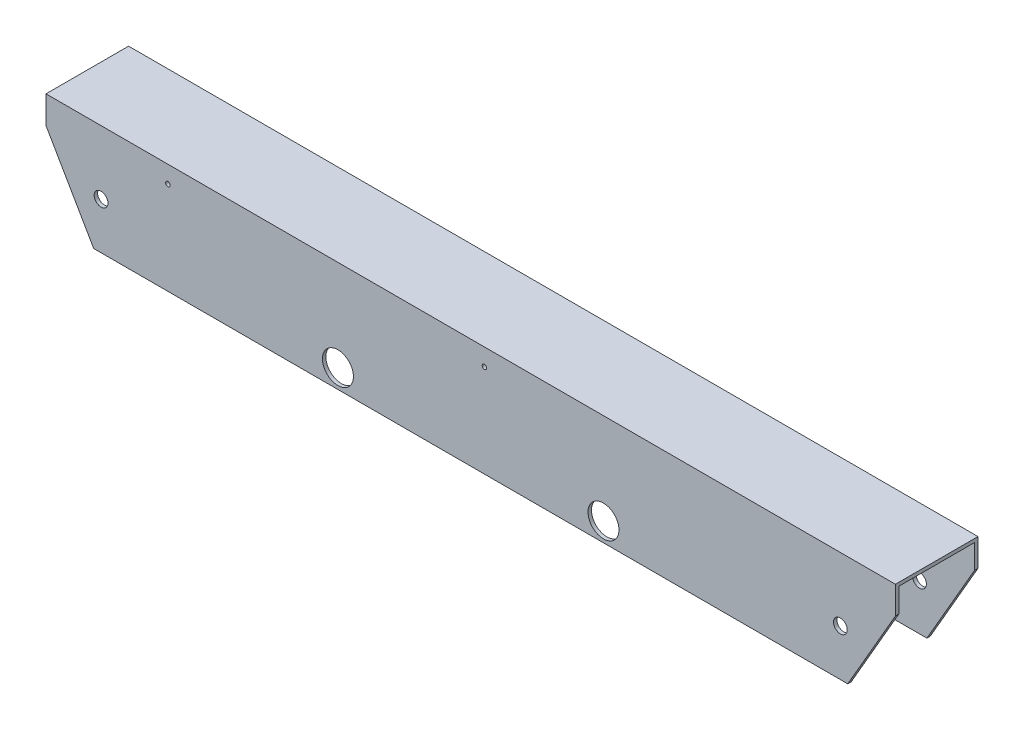
ISO-10303-21;
HEADER;
FILE_DESCRIPTION(('STEP AP214'),'2;1');
FILE_NAME('part.step','',(''),(''),'','','');
FILE_SCHEMA(('AUTOMOTIVE_DESIGN { 1 0 10303 214 1 1 1 1 }'));
ENDSEC;
DATA;
#1=APPLICATION_CONTEXT('core data for automotive mechanical design processes');
#2=APPLICATION_PROTOCOL_DEFINITION('international standard','automotive_design',2000,#1);
#3=PRODUCT_CONTEXT('',#1,'mechanical');
#4=PRODUCT('Part','Part','',(#3));
#5=PRODUCT_RELATED_PRODUCT_CATEGORY('part','',(#4));
#6=PRODUCT_DEFINITION_FORMATION('','',#4);
#7=PRODUCT_DEFINITION_CONTEXT('part definition',#1,'design');
#8=PRODUCT_DEFINITION('design','',#6,#7);
#9=PRODUCT_DEFINITION_SHAPE('','',#8);
#10=(LENGTH_UNIT() NAMED_UNIT(*) SI_UNIT(.MILLI.,.METRE.));
#11=(NAMED_UNIT(*) PLANE_ANGLE_UNIT() SI_UNIT($,.RADIAN.));
#12=(NAMED_UNIT(*) SI_UNIT($,.STERADIAN.) SOLID_ANGLE_UNIT());
#13=UNCERTAINTY_MEASURE_WITH_UNIT(LENGTH_MEASURE(1.E-05),#10,'distance_accuracy_value','');
#14=(GEOMETRIC_REPRESENTATION_CONTEXT(3) GLOBAL_UNCERTAINTY_ASSIGNED_CONTEXT((#13)) GLOBAL_UNIT_ASSIGNED_CONTEXT((#10,
#11,#12)) REPRESENTATION_CONTEXT('',''));
#15=CARTESIAN_POINT('',(0.,0.,0.));
#16=DIRECTION('',(0.,0.,1.));
#17=DIRECTION('',(1.,0.,0.));
#18=AXIS2_PLACEMENT_3D('',#15,#16,#17);
#19=CARTESIAN_POINT('',(391.865756272,-50.8,-38.1));
#20=DIRECTION('',(0.,1.,0.));
#21=DIRECTION('',(0.,0.,1.));
#22=AXIS2_PLACEMENT_3D('',#19,#20,#21);
#23=PLANE('',#22);
#24=DIRECTION('',(-1.,0.,0.));
#25=VECTOR('',#24,1.);
#26=CARTESIAN_POINT('',(391.865756272,-50.8,-38.1));
#27=LINE('',#26,#25);
#28=CARTESIAN_POINT('',(347.87166575975,-50.7999999999999,-38.1));
#29=VERTEX_POINT('',#28);
#30=CARTESIAN_POINT('',(-347.87166575975,-50.8,-38.1));
#31=VERTEX_POINT('',#30);
#32=EDGE_CURVE('E199',#29,#31,#27,.T.);
#33=ORIENTED_EDGE('',*,*,#32,.F.);
#34=DIRECTION('',(0.,0.,1.));
#35=VECTOR('',#34,1.);
#36=CARTESIAN_POINT('',(347.87166575975,-50.7999999999999,-63.5));
#37=LINE('',#36,#35);
#38=CARTESIAN_POINT('',(347.87166575975,-50.7999999999999,-34.925));
#39=VERTEX_POINT('',#38);
#40=EDGE_CURVE('E182',#29,#39,#37,.T.);
#41=ORIENTED_EDGE('',*,*,#40,.T.);
#42=DIRECTION('',(-1.,0.,0.));
#43=VECTOR('',#42,1.);
#44=CARTESIAN_POINT('',(391.865756272,-50.8,-34.925));
#45=LINE('',#44,#43);
#46=CARTESIAN_POINT('',(-347.87166575975,-50.8,-34.925));
#47=VERTEX_POINT('',#46);
#48=EDGE_CURVE('E289',#39,#47,#45,.T.);
#49=ORIENTED_EDGE('',*,*,#48,.T.);
#50=DIRECTION('',(0.,0.,1.));
#51=VECTOR('',#50,1.);
#52=CARTESIAN_POINT('',(-347.87166575975,-50.8,-63.5));
#53=LINE('',#52,#51);
#54=EDGE_CURVE('E412',#31,#47,#53,.T.);
#55=ORIENTED_EDGE('',*,*,#54,.F.);
#56=EDGE_LOOP('',(#33,#41,#49,#55));
#57=FACE_BOUND('',#56,.T.);
#58=ADVANCED_FACE('F33',(#57),#23,.F.);
#59=CARTESIAN_POINT('',(391.865756272,50.8,-38.1));
#60=DIRECTION('',(0.,0.,1.));
#61=DIRECTION('',(0.,-1.,0.));
#62=AXIS2_PLACEMENT_3D('',#59,#60,#61);
#63=PLANE('',#62);
#64=DIRECTION('',(1.,0.,0.));
#65=VECTOR('',#64,1.);
#66=CARTESIAN_POINT('',(-266.7,47.625,-38.1));
#67=LINE('',#66,#65);
#68=CARTESIAN_POINT('',(-292.1,47.625,-38.1));
#69=VERTEX_POINT('',#68);
#70=CARTESIAN_POINT('',(-266.7,47.625,-38.1));
#71=VERTEX_POINT('',#70);
#72=EDGE_CURVE('E402',#69,#71,#67,.T.);
#73=ORIENTED_EDGE('',*,*,#72,.F.);
#74=DIRECTION('',(0.,1.,0.));
#75=VECTOR('',#74,1.);
#76=CARTESIAN_POINT('',(-292.1,22.225,-38.1));
#77=LINE('',#76,#75);
#78=CARTESIAN_POINT('',(-292.1,22.225,-38.1));
#79=VERTEX_POINT('',#78);
#80=EDGE_CURVE('E405',#79,#69,#77,.T.);
#81=ORIENTED_EDGE('',*,*,#80,.F.);
#82=DIRECTION('',(-1.,0.,0.));
#83=VECTOR('',#82,1.);
#84=CARTESIAN_POINT('',(-266.7,22.225,-38.1));
#85=LINE('',#84,#83);
#86=CARTESIAN_POINT('',(-266.7,22.225,-38.1));
#87=VERTEX_POINT('',#86);
#88=EDGE_CURVE('E392',#87,#79,#85,.T.);
#89=ORIENTED_EDGE('',*,*,#88,.F.);
#90=DIRECTION('',(0.,-1.,0.));
#91=VECTOR('',#90,1.);
#92=CARTESIAN_POINT('',(-266.7,22.225,-38.1));
#93=LINE('',#92,#91);
#94=EDGE_CURVE('E399',#71,#87,#93,.T.);
#95=ORIENTED_EDGE('',*,*,#94,.F.);
#96=EDGE_LOOP('',(#73,#81,#89,#95));
#97=FACE_BOUND('',#96,.T.);
#98=DIRECTION('',(1.,0.,0.));
#99=VECTOR('',#98,1.);
#100=CARTESIAN_POINT('',(25.4,47.625,-38.1));
#101=LINE('',#100,#99);
#102=CARTESIAN_POINT('',(0.,47.625,-38.1));
#103=VERTEX_POINT('',#102);
#104=CARTESIAN_POINT('',(25.4,47.625,-38.1));
#105=VERTEX_POINT('',#104);
#106=EDGE_CURVE('E382',#103,#105,#101,.T.);
#107=ORIENTED_EDGE('',*,*,#106,.F.);
#108=DIRECTION('',(0.,1.,0.));
#109=VECTOR('',#108,1.);
#110=CARTESIAN_POINT('',(0.,22.225,-38.1));
#111=LINE('',#110,#109);
#112=CARTESIAN_POINT('',(0.,22.225,-38.1));
#113=VERTEX_POINT('',#112);
#114=EDGE_CURVE('E385',#113,#103,#111,.T.);
#115=ORIENTED_EDGE('',*,*,#114,.F.);
#116=DIRECTION('',(-1.,0.,0.));
#117=VECTOR('',#116,1.);
#118=CARTESIAN_POINT('',(25.4,22.225,-38.1));
#119=LINE('',#118,#117);
#120=CARTESIAN_POINT('',(25.4,22.225,-38.1));
#121=VERTEX_POINT('',#120);
#122=EDGE_CURVE('E372',#121,#113,#119,.T.);
#123=ORIENTED_EDGE('',*,*,#122,.F.);
#124=DIRECTION('',(0.,-1.,0.));
#125=VECTOR('',#124,1.);
#126=CARTESIAN_POINT('',(25.4,22.225,-38.1));
#127=LINE('',#126,#125);
#128=EDGE_CURVE('E379',#105,#121,#127,.T.);
#129=ORIENTED_EDGE('',*,*,#128,.F.);
#130=EDGE_LOOP('',(#107,#115,#123,#129));
#131=FACE_BOUND('',#130,.T.);
#132=CARTESIAN_POINT('',(84.41182,-35.123476108,-38.1));
#133=DIRECTION('',(0.,0.,-1.));
#134=DIRECTION('',(0.,1.,0.));
#135=AXIS2_PLACEMENT_3D('',#132,#133,#134);
#136=CIRCLE('',#135,3.302);
#137=CARTESIAN_POINT('',(84.41182,-31.821476108,-38.1));
#138=VERTEX_POINT('',#137);
#139=EDGE_CURVE('E237',#138,#138,#136,.T.);
#140=ORIENTED_EDGE('',*,*,#139,.F.);
#141=EDGE_LOOP('',(#140));
#142=FACE_BOUND('',#141,.T.);
#143=CARTESIAN_POINT('',(84.41182,41.076523892,-38.1));
#144=DIRECTION('',(0.,0.,-1.));
#145=DIRECTION('',(0.,1.,0.));
#146=AXIS2_PLACEMENT_3D('',#143,#144,#145);
#147=CIRCLE('',#146,3.302);
#148=CARTESIAN_POINT('',(84.41182,44.378523892,-38.1));
#149=VERTEX_POINT('',#148);
#150=EDGE_CURVE('E233',#149,#149,#147,.T.);
#151=ORIENTED_EDGE('',*,*,#150,.F.);
#152=EDGE_LOOP('',(#151));
#153=FACE_BOUND('',#152,.T.);
#154=CARTESIAN_POINT('',(160.61182,41.076523892,-38.1));
#155=DIRECTION('',(0.,0.,-1.));
#156=DIRECTION('',(0.,1.,0.));
#157=AXIS2_PLACEMENT_3D('',#154,#155,#156);
#158=CIRCLE('',#157,3.30200000000001);
#159=CARTESIAN_POINT('',(160.61182,44.378523892,-38.1));
#160=VERTEX_POINT('',#159);
#161=EDGE_CURVE('E229',#160,#160,#158,.T.);
#162=ORIENTED_EDGE('',*,*,#161,.F.);
#163=EDGE_LOOP('',(#162));
#164=FACE_BOUND('',#163,.T.);
#165=CARTESIAN_POINT('',(160.61182,-35.123476108,-38.1));
#166=DIRECTION('',(0.,0.,-1.));
#167=DIRECTION('',(0.,1.,0.));
#168=AXIS2_PLACEMENT_3D('',#165,#166,#167);
#169=CIRCLE('',#168,3.30200000000001);
#170=CARTESIAN_POINT('',(160.61182,-31.821476108,-38.1));
#171=VERTEX_POINT('',#170);
#172=EDGE_CURVE('E225',#171,#171,#169,.T.);
#173=ORIENTED_EDGE('',*,*,#172,.F.);
#174=EDGE_LOOP('',(#173));
#175=FACE_BOUND('',#174,.T.);
#176=CARTESIAN_POINT('',(-122.51182,-33.3375,-38.1));
#177=DIRECTION('',(0.,0.,1.));
#178=DIRECTION('',(0.,-1.,0.));
#179=AXIS2_PLACEMENT_3D('',#176,#177,#178);
#180=CIRCLE('',#179,14.2875);
#181=CARTESIAN_POINT('',(-122.51182,-47.625,-38.1));
#182=VERTEX_POINT('',#181);
#183=EDGE_CURVE('E352',#182,#182,#180,.T.);
#184=ORIENTED_EDGE('',*,*,#183,.T.);
#185=EDGE_LOOP('',(#184));
#186=FACE_BOUND('',#185,.T.);
#187=CARTESIAN_POINT('',(341.06575618739,-7.93750000000003,-38.1));
#188=DIRECTION('',(0.,0.,1.));
#189=DIRECTION('',(0.,-1.,0.));
#190=AXIS2_PLACEMENT_3D('',#187,#188,#189);
#191=CIRCLE('',#190,6.35);
#192=CARTESIAN_POINT('',(341.06575618739,-14.2875,-38.1));
#193=VERTEX_POINT('',#192);
#194=EDGE_CURVE('E333',#193,#193,#191,.T.);
#195=ORIENTED_EDGE('',*,*,#194,.T.);
#196=EDGE_LOOP('',(#195));
#197=FACE_BOUND('',#196,.T.);
#198=CARTESIAN_POINT('',(122.51182,-33.3375,-38.1));
#199=DIRECTION('',(0.,0.,1.));
#200=DIRECTION('',(0.,-1.,0.));
#201=AXIS2_PLACEMENT_3D('',#198,#199,#200);
#202=CIRCLE('',#201,14.2875);
#203=CARTESIAN_POINT('',(122.51182,-47.625,-38.1));
#204=VERTEX_POINT('',#203);
#205=EDGE_CURVE('E326',#204,#204,#202,.T.);
#206=ORIENTED_EDGE('',*,*,#205,.T.);
#207=EDGE_LOOP('',(#206));
#208=FACE_BOUND('',#207,.T.);
#209=CARTESIAN_POINT('',(-341.06575618739,-7.93750000000003,-38.1));
#210=DIRECTION('',(0.,0.,1.));
#211=DIRECTION('',(0.,-1.,0.));
#212=AXIS2_PLACEMENT_3D('',#209,#210,#211);
#213=CIRCLE('',#212,6.35);
#214=CARTESIAN_POINT('',(-341.06575618739,-14.2875,-38.1));
#215=VERTEX_POINT('',#214);
#216=EDGE_CURVE('E311',#215,#215,#213,.T.);
#217=ORIENTED_EDGE('',*,*,#216,.T.);
#218=EDGE_LOOP('',(#217));
#219=FACE_BOUND('',#218,.T.);
#220=DIRECTION('',(0.,1.,0.));
#221=VECTOR('',#220,1.);
#222=CARTESIAN_POINT('',(391.865756272,50.8,-38.1));
#223=LINE('',#222,#221);
#224=CARTESIAN_POINT('',(391.865756272,25.4,-38.1));
#225=VERTEX_POINT('',#224);
#226=CARTESIAN_POINT('',(391.865756272,50.8,-38.1));
#227=VERTEX_POINT('',#226);
#228=EDGE_CURVE('E280',#225,#227,#223,.T.);
#229=ORIENTED_EDGE('',*,*,#228,.F.);
#230=DIRECTION('',(-0.500000000000005,-0.866025403784436,0.));
#231=VECTOR('',#230,1.);
#232=CARTESIAN_POINT('',(402.864278900063,44.4499999999999,-38.1));
#233=LINE('',#232,#231);
#234=EDGE_CURVE('E54',#225,#29,#233,.T.);
#235=ORIENTED_EDGE('',*,*,#234,.T.);
#236=ORIENTED_EDGE('',*,*,#32,.T.);
#237=DIRECTION('',(-0.500000000000004,0.866025403784436,0.));
#238=VECTOR('',#237,1.);
#239=CARTESIAN_POINT('',(-206.931400764059,-294.915699804755,-38.1));
#240=LINE('',#239,#238);
#241=CARTESIAN_POINT('',(-391.865756272,25.4,-38.1));
#242=VERTEX_POINT('',#241);
#243=EDGE_CURVE('E407',#31,#242,#240,.T.);
#244=ORIENTED_EDGE('',*,*,#243,.T.);
#245=DIRECTION('',(0.,1.,0.));
#246=VECTOR('',#245,1.);
#247=CARTESIAN_POINT('',(-391.865756272,50.8,-38.1));
#248=LINE('',#247,#246);
#249=CARTESIAN_POINT('',(-391.865756272,50.8,-38.1));
#250=VERTEX_POINT('',#249);
#251=EDGE_CURVE('E268',#242,#250,#248,.T.);
#252=ORIENTED_EDGE('',*,*,#251,.T.);
#253=DIRECTION('',(-1.,0.,0.));
#254=VECTOR('',#253,1.);
#255=CARTESIAN_POINT('',(391.865756272,50.8,-38.1));
#256=LINE('',#255,#254);
#257=EDGE_CURVE('E191',#227,#250,#256,.T.);
#258=ORIENTED_EDGE('',*,*,#257,.F.);
#259=EDGE_LOOP('',(#229,#235,#236,#244,#252,#258));
#260=FACE_BOUND('',#259,.T.);
#261=ADVANCED_FACE('F429',(#97,#131,#142,#153,#164,#175,#186,#197,#208,#219,#260),#63,.F.);
#262=CARTESIAN_POINT('',(391.865756272,50.8,38.1));
#263=DIRECTION('',(0.,-1.,0.));
#264=DIRECTION('',(0.,0.,-1.));
#265=AXIS2_PLACEMENT_3D('',#262,#263,#264);
#266=PLANE('',#265);
#267=DIRECTION('',(0.,0.,1.));
#268=VECTOR('',#267,1.);
#269=CARTESIAN_POINT('',(-391.865756272,50.8,38.1));
#270=LINE('',#269,#268);
#271=CARTESIAN_POINT('',(-391.865756272,50.8,38.1));
#272=VERTEX_POINT('',#271);
#273=EDGE_CURVE('E306',#250,#272,#270,.T.);
#274=ORIENTED_EDGE('',*,*,#273,.T.);
#275=DIRECTION('',(-1.,0.,0.));
#276=VECTOR('',#275,1.);
#277=CARTESIAN_POINT('',(391.865756272,50.8,38.1));
#278=LINE('',#277,#276);
#279=CARTESIAN_POINT('',(391.865756272,50.8,38.1));
#280=VERTEX_POINT('',#279);
#281=EDGE_CURVE('E188',#280,#272,#278,.T.);
#282=ORIENTED_EDGE('',*,*,#281,.F.);
#283=DIRECTION('',(0.,0.,1.));
#284=VECTOR('',#283,1.);
#285=CARTESIAN_POINT('',(391.865756272,50.8,38.1));
#286=LINE('',#285,#284);
#287=EDGE_CURVE('E283',#227,#280,#286,.T.);
#288=ORIENTED_EDGE('',*,*,#287,.F.);
#289=ORIENTED_EDGE('',*,*,#257,.T.);
#290=EDGE_LOOP('',(#274,#282,#288,#289));
#291=FACE_BOUND('',#290,.T.);
#292=ADVANCED_FACE('F465',(#291),#266,.F.);
#293=CARTESIAN_POINT('',(391.865756272,50.8,38.1));
#294=DIRECTION('',(0.,0.,-1.));
#295=DIRECTION('',(0.,1.,0.));
#296=AXIS2_PLACEMENT_3D('',#293,#294,#295);
#297=PLANE('',#296);
#298=CARTESIAN_POINT('',(-122.51182,-33.3375,38.1));
#299=DIRECTION('',(0.,0.,1.));
#300=DIRECTION('',(1.,0.,0.));
#301=AXIS2_PLACEMENT_3D('',#298,#299,#300);
#302=CIRCLE('',#301,14.2875);
#303=CARTESIAN_POINT('',(-108.22432,-33.3375,38.1));
#304=VERTEX_POINT('',#303);
#305=EDGE_CURVE('E221',#304,#304,#302,.T.);
#306=ORIENTED_EDGE('',*,*,#305,.F.);
#307=EDGE_LOOP('',(#306));
#308=FACE_BOUND('',#307,.T.);
#309=CARTESIAN_POINT('',(-279.4,34.925,38.1));
#310=DIRECTION('',(0.,0.,1.));
#311=DIRECTION('',(1.,0.,0.));
#312=AXIS2_PLACEMENT_3D('',#309,#310,#311);
#313=CIRCLE('',#312,2.08280000000001);
#314=CARTESIAN_POINT('',(-277.3172,34.925,38.1));
#315=VERTEX_POINT('',#314);
#316=EDGE_CURVE('E349',#315,#315,#313,.T.);
#317=ORIENTED_EDGE('',*,*,#316,.F.);
#318=EDGE_LOOP('',(#317));
#319=FACE_BOUND('',#318,.T.);
#320=CARTESIAN_POINT('',(12.7,34.925,38.1));
#321=DIRECTION('',(0.,0.,1.));
#322=DIRECTION('',(1.,0.,0.));
#323=AXIS2_PLACEMENT_3D('',#320,#321,#322);
#324=CIRCLE('',#323,2.0828);
#325=CARTESIAN_POINT('',(14.7828,34.925,38.1));
#326=VERTEX_POINT('',#325);
#327=EDGE_CURVE('E343',#326,#326,#324,.T.);
#328=ORIENTED_EDGE('',*,*,#327,.F.);
#329=EDGE_LOOP('',(#328));
#330=FACE_BOUND('',#329,.T.);
#331=CARTESIAN_POINT('',(341.06575618739,-7.93750000000003,38.1));
#332=DIRECTION('',(0.,0.,1.));
#333=DIRECTION('',(-1.,0.,0.));
#334=AXIS2_PLACEMENT_3D('',#331,#332,#333);
#335=CIRCLE('',#334,6.35);
#336=CARTESIAN_POINT('',(334.71575618739,-7.93750000000003,38.1));
#337=VERTEX_POINT('',#336);
#338=EDGE_CURVE('E216',#337,#337,#335,.T.);
#339=ORIENTED_EDGE('',*,*,#338,.F.);
#340=EDGE_LOOP('',(#339));
#341=FACE_BOUND('',#340,.T.);
#342=CARTESIAN_POINT('',(122.51182,-33.3375,38.1));
#343=DIRECTION('',(0.,0.,1.));
#344=DIRECTION('',(-1.,0.,0.));
#345=AXIS2_PLACEMENT_3D('',#342,#343,#344);
#346=CIRCLE('',#345,14.2875);
#347=CARTESIAN_POINT('',(108.22432,-33.3375,38.1));
#348=VERTEX_POINT('',#347);
#349=EDGE_CURVE('E211',#348,#348,#346,.T.);
#350=ORIENTED_EDGE('',*,*,#349,.F.);
#351=EDGE_LOOP('',(#350));
#352=FACE_BOUND('',#351,.T.);
#353=CARTESIAN_POINT('',(-341.06575618739,-7.93750000000003,38.1));
#354=DIRECTION('',(0.,0.,1.));
#355=DIRECTION('',(1.,0.,0.));
#356=AXIS2_PLACEMENT_3D('',#353,#354,#355);
#357=CIRCLE('',#356,6.35);
#358=CARTESIAN_POINT('',(-334.71575618739,-7.93750000000003,38.1));
#359=VERTEX_POINT('',#358);
#360=EDGE_CURVE('E206',#359,#359,#357,.T.);
#361=ORIENTED_EDGE('',*,*,#360,.F.);
#362=EDGE_LOOP('',(#361));
#363=FACE_BOUND('',#362,.T.);
#364=DIRECTION('',(-1.,0.,0.));
#365=VECTOR('',#364,1.);
#366=CARTESIAN_POINT('',(391.865756272,-50.8,38.1));
#367=LINE('',#366,#365);
#368=CARTESIAN_POINT('',(347.87166575975,-50.7999999999999,38.1));
#369=VERTEX_POINT('',#368);
#370=CARTESIAN_POINT('',(-347.87166575975,-50.8,38.1));
#371=VERTEX_POINT('',#370);
#372=EDGE_CURVE('E179',#369,#371,#367,.T.);
#373=ORIENTED_EDGE('',*,*,#372,.F.);
#374=DIRECTION('',(-0.500000000000005,-0.866025403784436,0.));
#375=VECTOR('',#374,1.);
#376=CARTESIAN_POINT('',(391.865756272,25.4,38.1));
#377=LINE('',#376,#375);
#378=CARTESIAN_POINT('',(391.865756272,25.4,38.1));
#379=VERTEX_POINT('',#378);
#380=EDGE_CURVE('E166',#379,#369,#377,.T.);
#381=ORIENTED_EDGE('',*,*,#380,.F.);
#382=DIRECTION('',(0.,-1.,0.));
#383=VECTOR('',#382,1.);
#384=CARTESIAN_POINT('',(391.865756272,50.8,38.1));
#385=LINE('',#384,#383);
#386=EDGE_CURVE('E317',#280,#379,#385,.T.);
#387=ORIENTED_EDGE('',*,*,#386,.F.);
#388=ORIENTED_EDGE('',*,*,#281,.T.);
#389=DIRECTION('',(0.,-1.,0.));
#390=VECTOR('',#389,1.);
#391=CARTESIAN_POINT('',(-391.865756272,50.8,38.1));
#392=LINE('',#391,#390);
#393=CARTESIAN_POINT('',(-391.865756272,25.4,38.1));
#394=VERTEX_POINT('',#393);
#395=EDGE_CURVE('E305',#272,#394,#392,.T.);
#396=ORIENTED_EDGE('',*,*,#395,.T.);
#397=DIRECTION('',(-0.500000000000004,0.866025403784436,0.));
#398=VECTOR('',#397,1.);
#399=CARTESIAN_POINT('',(-391.865756272,25.4,38.1));
#400=LINE('',#399,#398);
#401=EDGE_CURVE('E187',#371,#394,#400,.T.);
#402=ORIENTED_EDGE('',*,*,#401,.F.);
#403=EDGE_LOOP('',(#373,#381,#387,#388,#396,#402));
#404=FACE_BOUND('',#403,.T.);
#405=ADVANCED_FACE('F185',(#308,#319,#330,#341,#352,#363,#404),#297,.F.);
#406=CARTESIAN_POINT('',(391.865756272,-50.8,38.1));
#407=DIRECTION('',(0.,1.,0.));
#408=DIRECTION('',(0.,0.,1.));
#409=AXIS2_PLACEMENT_3D('',#406,#407,#408);
#410=PLANE('',#409);
#411=DIRECTION('',(-1.,0.,0.));
#412=VECTOR('',#411,1.);
#413=CARTESIAN_POINT('',(391.865756272,-50.8,34.925));
#414=LINE('',#413,#412);
#415=CARTESIAN_POINT('',(347.87166575975,-50.7999999999999,34.925));
#416=VERTEX_POINT('',#415);
#417=CARTESIAN_POINT('',(-347.87166575975,-50.8,34.925));
#418=VERTEX_POINT('',#417);
#419=EDGE_CURVE('E181',#416,#418,#414,.T.);
#420=ORIENTED_EDGE('',*,*,#419,.F.);
#421=EDGE_CURVE('E169',#416,#369,#37,.T.);
#422=ORIENTED_EDGE('',*,*,#421,.T.);
#423=ORIENTED_EDGE('',*,*,#372,.T.);
#424=EDGE_CURVE('E413',#418,#371,#53,.T.);
#425=ORIENTED_EDGE('',*,*,#424,.F.);
#426=EDGE_LOOP('',(#420,#422,#423,#425));
#427=FACE_BOUND('',#426,.T.);
#428=ADVANCED_FACE('F177',(#427),#410,.F.);
#429=CARTESIAN_POINT('',(391.865756272,47.625,34.925));
#430=DIRECTION('',(0.,0.,1.));
#431=DIRECTION('',(0.,-1.,0.));
#432=AXIS2_PLACEMENT_3D('',#429,#430,#431);
#433=PLANE('',#432);
#434=CARTESIAN_POINT('',(-122.51182,-33.3375,34.925));
#435=DIRECTION('',(0.,0.,1.));
#436=DIRECTION('',(0.,-1.,0.));
#437=AXIS2_PLACEMENT_3D('',#434,#435,#436);
#438=CIRCLE('',#437,14.2875);
#439=CARTESIAN_POINT('',(-122.51182,-47.625,34.925));
#440=VERTEX_POINT('',#439);
#441=EDGE_CURVE('E220',#440,#440,#438,.T.);
#442=ORIENTED_EDGE('',*,*,#441,.T.);
#443=EDGE_LOOP('',(#442));
#444=FACE_BOUND('',#443,.T.);
#445=CARTESIAN_POINT('',(-279.4,34.925,34.925));
#446=DIRECTION('',(0.,0.,1.));
#447=DIRECTION('',(0.,-1.,0.));
#448=AXIS2_PLACEMENT_3D('',#445,#446,#447);
#449=CIRCLE('',#448,2.08280000000001);
#450=CARTESIAN_POINT('',(-279.4,32.8422,34.925));
#451=VERTEX_POINT('',#450);
#452=EDGE_CURVE('E346',#451,#451,#449,.T.);
#453=ORIENTED_EDGE('',*,*,#452,.T.);
#454=EDGE_LOOP('',(#453));
#455=FACE_BOUND('',#454,.T.);
#456=CARTESIAN_POINT('',(12.7,34.925,34.925));
#457=DIRECTION('',(0.,0.,1.));
#458=DIRECTION('',(0.,-1.,0.));
#459=AXIS2_PLACEMENT_3D('',#456,#457,#458);
#460=CIRCLE('',#459,2.0828);
#461=CARTESIAN_POINT('',(12.7,32.8422,34.925));
#462=VERTEX_POINT('',#461);
#463=EDGE_CURVE('E340',#462,#462,#460,.T.);
#464=ORIENTED_EDGE('',*,*,#463,.T.);
#465=EDGE_LOOP('',(#464));
#466=FACE_BOUND('',#465,.T.);
#467=CARTESIAN_POINT('',(341.06575618739,-7.93750000000003,34.925));
#468=DIRECTION('',(0.,0.,1.));
#469=DIRECTION('',(0.,-1.,0.));
#470=AXIS2_PLACEMENT_3D('',#467,#468,#469);
#471=CIRCLE('',#470,6.35);
#472=CARTESIAN_POINT('',(341.06575618739,-14.2875,34.925));
#473=VERTEX_POINT('',#472);
#474=EDGE_CURVE('E215',#473,#473,#471,.T.);
#475=ORIENTED_EDGE('',*,*,#474,.T.);
#476=EDGE_LOOP('',(#475));
#477=FACE_BOUND('',#476,.T.);
#478=CARTESIAN_POINT('',(122.51182,-33.3375,34.925));
#479=DIRECTION('',(0.,0.,1.));
#480=DIRECTION('',(0.,-1.,0.));
#481=AXIS2_PLACEMENT_3D('',#478,#479,#480);
#482=CIRCLE('',#481,14.2875);
#483=CARTESIAN_POINT('',(122.51182,-47.625,34.925));
#484=VERTEX_POINT('',#483);
#485=EDGE_CURVE('E210',#484,#484,#482,.T.);
#486=ORIENTED_EDGE('',*,*,#485,.T.);
#487=EDGE_LOOP('',(#486));
#488=FACE_BOUND('',#487,.T.);
#489=CARTESIAN_POINT('',(-341.06575618739,-7.93750000000003,34.925));
#490=DIRECTION('',(0.,0.,1.));
#491=DIRECTION('',(0.,-1.,0.));
#492=AXIS2_PLACEMENT_3D('',#489,#490,#491);
#493=CIRCLE('',#492,6.35);
#494=CARTESIAN_POINT('',(-341.06575618739,-14.2875,34.925));
#495=VERTEX_POINT('',#494);
#496=EDGE_CURVE('E205',#495,#495,#493,.T.);
#497=ORIENTED_EDGE('',*,*,#496,.T.);
#498=EDGE_LOOP('',(#497));
#499=FACE_BOUND('',#498,.T.);
#500=DIRECTION('',(0.,1.,0.));
#501=VECTOR('',#500,1.);
#502=CARTESIAN_POINT('',(391.865756272,47.625,34.925));
#503=LINE('',#502,#501);
#504=CARTESIAN_POINT('',(391.865756272,25.4,34.925));
#505=VERTEX_POINT('',#504);
#506=CARTESIAN_POINT('',(391.865756272,47.625,34.925));
#507=VERTEX_POINT('',#506);
#508=EDGE_CURVE('E315',#505,#507,#503,.T.);
#509=ORIENTED_EDGE('',*,*,#508,.F.);
#510=DIRECTION('',(-0.500000000000005,-0.866025403784436,0.));
#511=VECTOR('',#510,1.);
#512=CARTESIAN_POINT('',(401.489463571555,42.0687499999999,34.925));
#513=LINE('',#512,#511);
#514=EDGE_CURVE('E47',#505,#416,#513,.T.);
#515=ORIENTED_EDGE('',*,*,#514,.T.);
#516=ORIENTED_EDGE('',*,*,#419,.T.);
#517=DIRECTION('',(-0.500000000000004,0.866025403784436,0.));
#518=VECTOR('',#517,1.);
#519=CARTESIAN_POINT('',(-205.556585435551,-297.296949804755,34.925));
#520=LINE('',#519,#518);
#521=CARTESIAN_POINT('',(-391.865756272,25.4,34.925));
#522=VERTEX_POINT('',#521);
#523=EDGE_CURVE('E409',#418,#522,#520,.T.);
#524=ORIENTED_EDGE('',*,*,#523,.T.);
#525=DIRECTION('',(0.,1.,0.));
#526=VECTOR('',#525,1.);
#527=CARTESIAN_POINT('',(-391.865756272,47.625,34.925));
#528=LINE('',#527,#526);
#529=CARTESIAN_POINT('',(-391.865756272,47.625,34.925));
#530=VERTEX_POINT('',#529);
#531=EDGE_CURVE('E285',#522,#530,#528,.T.);
#532=ORIENTED_EDGE('',*,*,#531,.T.);
#533=DIRECTION('',(-1.,0.,0.));
#534=VECTOR('',#533,1.);
#535=CARTESIAN_POINT('',(391.865756272,47.625,34.925));
#536=LINE('',#535,#534);
#537=EDGE_CURVE('E193',#507,#530,#536,.T.);
#538=ORIENTED_EDGE('',*,*,#537,.F.);
#539=EDGE_LOOP('',(#509,#515,#516,#524,#532,#538));
#540=FACE_BOUND('',#539,.T.);
#541=ADVANCED_FACE('F526',(#444,#455,#466,#477,#488,#499,#540),#433,.F.);
#542=CARTESIAN_POINT('',(391.865756272,47.625,34.925));
#543=DIRECTION('',(0.,1.,0.));
#544=DIRECTION('',(0.,0.,1.));
#545=AXIS2_PLACEMENT_3D('',#542,#543,#544);
#546=PLANE('',#545);
#547=DIRECTION('',(0.,0.,-1.));
#548=VECTOR('',#547,1.);
#549=CARTESIAN_POINT('',(-266.7,47.625,-14.986));
#550=LINE('',#549,#548);
#551=CARTESIAN_POINT('',(-266.7,47.625,-34.925));
#552=VERTEX_POINT('',#551);
#553=EDGE_CURVE('E391',#552,#71,#550,.T.);
#554=ORIENTED_EDGE('',*,*,#553,.F.);
#555=DIRECTION('',(-1.,0.,0.));
#556=VECTOR('',#555,1.);
#557=CARTESIAN_POINT('',(391.865756272,47.625,-34.925));
#558=LINE('',#557,#556);
#559=CARTESIAN_POINT('',(0.,47.625,-34.925));
#560=VERTEX_POINT('',#559);
#561=EDGE_CURVE('E294',#560,#552,#558,.T.);
#562=ORIENTED_EDGE('',*,*,#561,.F.);
#563=DIRECTION('',(0.,0.,-1.));
#564=VECTOR('',#563,1.);
#565=CARTESIAN_POINT('',(0.,47.625,-14.986));
#566=LINE('',#565,#564);
#567=EDGE_CURVE('E368',#560,#103,#566,.T.);
#568=ORIENTED_EDGE('',*,*,#567,.T.);
#569=ORIENTED_EDGE('',*,*,#106,.T.);
#570=DIRECTION('',(0.,0.,-1.));
#571=VECTOR('',#570,1.);
#572=CARTESIAN_POINT('',(25.4,47.625,-14.986));
#573=LINE('',#572,#571);
#574=CARTESIAN_POINT('',(25.4,47.625,-34.925));
#575=VERTEX_POINT('',#574);
#576=EDGE_CURVE('E371',#575,#105,#573,.T.);
#577=ORIENTED_EDGE('',*,*,#576,.F.);
#578=CARTESIAN_POINT('',(391.865756272,47.625,-34.925));
#579=VERTEX_POINT('',#578);
#580=EDGE_CURVE('E292',#579,#575,#558,.T.);
#581=ORIENTED_EDGE('',*,*,#580,.F.);
#582=DIRECTION('',(0.,0.,-1.));
#583=VECTOR('',#582,1.);
#584=CARTESIAN_POINT('',(391.865756272,47.625,34.925));
#585=LINE('',#584,#583);
#586=EDGE_CURVE('E301',#507,#579,#585,.T.);
#587=ORIENTED_EDGE('',*,*,#586,.F.);
#588=ORIENTED_EDGE('',*,*,#537,.T.);
#589=DIRECTION('',(0.,0.,-1.));
#590=VECTOR('',#589,1.);
#591=CARTESIAN_POINT('',(-391.865756272,47.625,34.925));
#592=LINE('',#591,#590);
#593=CARTESIAN_POINT('',(-391.865756272,47.625,-34.925));
#594=VERTEX_POINT('',#593);
#595=EDGE_CURVE('E281',#530,#594,#592,.T.);
#596=ORIENTED_EDGE('',*,*,#595,.T.);
#597=CARTESIAN_POINT('',(-292.1,47.625,-34.925));
#598=VERTEX_POINT('',#597);
#599=EDGE_CURVE('E278',#598,#594,#558,.T.);
#600=ORIENTED_EDGE('',*,*,#599,.F.);
#601=DIRECTION('',(0.,0.,-1.));
#602=VECTOR('',#601,1.);
#603=CARTESIAN_POINT('',(-292.1,47.625,-14.986));
#604=LINE('',#603,#602);
#605=EDGE_CURVE('E388',#598,#69,#604,.T.);
#606=ORIENTED_EDGE('',*,*,#605,.T.);
#607=ORIENTED_EDGE('',*,*,#72,.T.);
#608=EDGE_LOOP('',(#554,#562,#568,#569,#577,#581,#587,#588,#596,#600,#606,#607));
#609=FACE_BOUND('',#608,.T.);
#610=ADVANCED_FACE('F299',(#609),#546,.F.);
#611=CARTESIAN_POINT('',(391.865756272,47.625,-34.925));
#612=DIRECTION('',(0.,0.,-1.));
#613=DIRECTION('',(0.,1.,0.));
#614=AXIS2_PLACEMENT_3D('',#611,#612,#613);
#615=PLANE('',#614);
#616=CARTESIAN_POINT('',(84.41182,-35.123476108,-34.925));
#617=DIRECTION('',(0.,0.,-1.));
#618=DIRECTION('',(0.,1.,0.));
#619=AXIS2_PLACEMENT_3D('',#616,#617,#618);
#620=CIRCLE('',#619,3.302);
#621=CARTESIAN_POINT('',(84.41182,-31.821476108,-34.925));
#622=VERTEX_POINT('',#621);
#623=EDGE_CURVE('E234',#622,#622,#620,.T.);
#624=ORIENTED_EDGE('',*,*,#623,.T.);
#625=EDGE_LOOP('',(#624));
#626=FACE_BOUND('',#625,.T.);
#627=CARTESIAN_POINT('',(84.41182,41.076523892,-34.925));
#628=DIRECTION('',(0.,0.,-1.));
#629=DIRECTION('',(0.,1.,0.));
#630=AXIS2_PLACEMENT_3D('',#627,#628,#629);
#631=CIRCLE('',#630,3.302);
#632=CARTESIAN_POINT('',(84.41182,44.378523892,-34.925));
#633=VERTEX_POINT('',#632);
#634=EDGE_CURVE('E230',#633,#633,#631,.T.);
#635=ORIENTED_EDGE('',*,*,#634,.T.);
#636=EDGE_LOOP('',(#635));
#637=FACE_BOUND('',#636,.T.);
#638=CARTESIAN_POINT('',(160.61182,41.076523892,-34.925));
#639=DIRECTION('',(0.,0.,-1.));
#640=DIRECTION('',(0.,1.,0.));
#641=AXIS2_PLACEMENT_3D('',#638,#639,#640);
#642=CIRCLE('',#641,3.30200000000001);
#643=CARTESIAN_POINT('',(160.61182,44.378523892,-34.925));
#644=VERTEX_POINT('',#643);
#645=EDGE_CURVE('E226',#644,#644,#642,.T.);
#646=ORIENTED_EDGE('',*,*,#645,.T.);
#647=EDGE_LOOP('',(#646));
#648=FACE_BOUND('',#647,.T.);
#649=CARTESIAN_POINT('',(160.61182,-35.123476108,-34.925));
#650=DIRECTION('',(0.,0.,-1.));
#651=DIRECTION('',(0.,1.,0.));
#652=AXIS2_PLACEMENT_3D('',#649,#650,#651);
#653=CIRCLE('',#652,3.30200000000001);
#654=CARTESIAN_POINT('',(160.61182,-31.821476108,-34.925));
#655=VERTEX_POINT('',#654);
#656=EDGE_CURVE('E222',#655,#655,#653,.T.);
#657=ORIENTED_EDGE('',*,*,#656,.T.);
#658=EDGE_LOOP('',(#657));
#659=FACE_BOUND('',#658,.T.);
#660=CARTESIAN_POINT('',(-122.51182,-33.3375,-34.925));
#661=DIRECTION('',(0.,0.,-1.));
#662=DIRECTION('',(0.,1.,0.));
#663=AXIS2_PLACEMENT_3D('',#660,#661,#662);
#664=CIRCLE('',#663,14.2875);
#665=CARTESIAN_POINT('',(-122.51182,-19.05,-34.925));
#666=VERTEX_POINT('',#665);
#667=EDGE_CURVE('E217',#666,#666,#664,.T.);
#668=ORIENTED_EDGE('',*,*,#667,.T.);
#669=EDGE_LOOP('',(#668));
#670=FACE_BOUND('',#669,.T.);
#671=CARTESIAN_POINT('',(341.06575618739,-7.93750000000003,-34.925));
#672=DIRECTION('',(0.,0.,-1.));
#673=DIRECTION('',(0.,1.,0.));
#674=AXIS2_PLACEMENT_3D('',#671,#672,#673);
#675=CIRCLE('',#674,6.35);
#676=CARTESIAN_POINT('',(341.06575618739,-1.58750000000003,-34.925));
#677=VERTEX_POINT('',#676);
#678=EDGE_CURVE('E212',#677,#677,#675,.T.);
#679=ORIENTED_EDGE('',*,*,#678,.T.);
#680=EDGE_LOOP('',(#679));
#681=FACE_BOUND('',#680,.T.);
#682=CARTESIAN_POINT('',(122.51182,-33.3375,-34.925));
#683=DIRECTION('',(0.,0.,-1.));
#684=DIRECTION('',(0.,1.,0.));
#685=AXIS2_PLACEMENT_3D('',#682,#683,#684);
#686=CIRCLE('',#685,14.2875);
#687=CARTESIAN_POINT('',(122.51182,-19.05,-34.925));
#688=VERTEX_POINT('',#687);
#689=EDGE_CURVE('E207',#688,#688,#686,.T.);
#690=ORIENTED_EDGE('',*,*,#689,.T.);
#691=EDGE_LOOP('',(#690));
#692=FACE_BOUND('',#691,.T.);
#693=CARTESIAN_POINT('',(-341.06575618739,-7.93750000000003,-34.925));
#694=DIRECTION('',(0.,0.,-1.));
#695=DIRECTION('',(0.,1.,0.));
#696=AXIS2_PLACEMENT_3D('',#693,#694,#695);
#697=CIRCLE('',#696,6.35);
#698=CARTESIAN_POINT('',(-341.06575618739,-1.58750000000003,-34.925));
#699=VERTEX_POINT('',#698);
#700=EDGE_CURVE('E202',#699,#699,#697,.T.);
#701=ORIENTED_EDGE('',*,*,#700,.T.);
#702=EDGE_LOOP('',(#701));
#703=FACE_BOUND('',#702,.T.);
#704=ORIENTED_EDGE('',*,*,#48,.F.);
#705=DIRECTION('',(0.500000000000005,0.866025403784436,0.));
#706=VECTOR('',#705,1.);
#707=CARTESIAN_POINT('',(401.489463571555,42.0687499999999,-34.925));
#708=LINE('',#707,#706);
#709=CARTESIAN_POINT('',(391.865756272,25.4,-34.925));
#710=VERTEX_POINT('',#709);
#711=EDGE_CURVE('E418',#39,#710,#708,.T.);
#712=ORIENTED_EDGE('',*,*,#711,.T.);
#713=DIRECTION('',(0.,-1.,0.));
#714=VECTOR('',#713,1.);
#715=CARTESIAN_POINT('',(391.865756272,47.625,-34.925));
#716=LINE('',#715,#714);
#717=EDGE_CURVE('E291',#579,#710,#716,.T.);
#718=ORIENTED_EDGE('',*,*,#717,.F.);
#719=ORIENTED_EDGE('',*,*,#580,.T.);
#720=DIRECTION('',(0.,-1.,0.));
#721=VECTOR('',#720,1.);
#722=CARTESIAN_POINT('',(25.4,47.625,-34.925));
#723=LINE('',#722,#721);
#724=CARTESIAN_POINT('',(25.4,22.225,-34.925));
#725=VERTEX_POINT('',#724);
#726=EDGE_CURVE('E201',#575,#725,#723,.T.);
#727=ORIENTED_EDGE('',*,*,#726,.T.);
#728=DIRECTION('',(-1.,0.,0.));
#729=VECTOR('',#728,1.);
#730=CARTESIAN_POINT('',(391.865756272,22.225,-34.925));
#731=LINE('',#730,#729);
#732=CARTESIAN_POINT('',(0.,22.225,-34.925));
#733=VERTEX_POINT('',#732);
#734=EDGE_CURVE('E240',#725,#733,#731,.T.);
#735=ORIENTED_EDGE('',*,*,#734,.T.);
#736=DIRECTION('',(0.,1.,0.));
#737=VECTOR('',#736,1.);
#738=CARTESIAN_POINT('',(0.,47.625,-34.925));
#739=LINE('',#738,#737);
#740=EDGE_CURVE('E243',#733,#560,#739,.T.);
#741=ORIENTED_EDGE('',*,*,#740,.T.);
#742=ORIENTED_EDGE('',*,*,#561,.T.);
#743=DIRECTION('',(0.,-1.,0.));
#744=VECTOR('',#743,1.);
#745=CARTESIAN_POINT('',(-266.7,47.625,-34.925));
#746=LINE('',#745,#744);
#747=CARTESIAN_POINT('',(-266.7,22.225,-34.925));
#748=VERTEX_POINT('',#747);
#749=EDGE_CURVE('E246',#552,#748,#746,.T.);
#750=ORIENTED_EDGE('',*,*,#749,.T.);
#751=DIRECTION('',(-1.,0.,0.));
#752=VECTOR('',#751,1.);
#753=CARTESIAN_POINT('',(391.865756272,22.225,-34.925));
#754=LINE('',#753,#752);
#755=CARTESIAN_POINT('',(-292.1,22.225,-34.925));
#756=VERTEX_POINT('',#755);
#757=EDGE_CURVE('E249',#748,#756,#754,.T.);
#758=ORIENTED_EDGE('',*,*,#757,.T.);
#759=DIRECTION('',(0.,1.,0.));
#760=VECTOR('',#759,1.);
#761=CARTESIAN_POINT('',(-292.1,47.625,-34.925));
#762=LINE('',#761,#760);
#763=EDGE_CURVE('E252',#756,#598,#762,.T.);
#764=ORIENTED_EDGE('',*,*,#763,.T.);
#765=ORIENTED_EDGE('',*,*,#599,.T.);
#766=DIRECTION('',(0.,-1.,0.));
#767=VECTOR('',#766,1.);
#768=CARTESIAN_POINT('',(-391.865756272,47.625,-34.925));
#769=LINE('',#768,#767);
#770=CARTESIAN_POINT('',(-391.865756272,25.4,-34.925));
#771=VERTEX_POINT('',#770);
#772=EDGE_CURVE('E266',#594,#771,#769,.T.);
#773=ORIENTED_EDGE('',*,*,#772,.T.);
#774=DIRECTION('',(0.500000000000004,-0.866025403784436,0.));
#775=VECTOR('',#774,1.);
#776=CARTESIAN_POINT('',(-205.556585435551,-297.296949804755,-34.925));
#777=LINE('',#776,#775);
#778=EDGE_CURVE('E276',#771,#47,#777,.T.);
#779=ORIENTED_EDGE('',*,*,#778,.T.);
#780=EDGE_LOOP('',(#704,#712,#718,#719,#727,#735,#741,#742,#750,#758,#764,#765,#773,#779));
#781=FACE_BOUND('',#780,.T.);
#782=ADVANCED_FACE('F275',(#626,#637,#648,#659,#670,#681,#692,#703,#781),#615,.F.);
#783=CARTESIAN_POINT('',(391.865756272,0.,0.));
#784=DIRECTION('',(1.,0.,0.));
#785=DIRECTION('',(0.,0.,-1.));
#786=AXIS2_PLACEMENT_3D('',#783,#784,#785);
#787=PLANE('',#786);
#788=DIRECTION('',(0.,0.,1.));
#789=VECTOR('',#788,1.);
#790=CARTESIAN_POINT('',(391.865756272,25.4,0.));
#791=LINE('',#790,#789);
#792=EDGE_CURVE('E11',#225,#710,#791,.T.);
#793=ORIENTED_EDGE('',*,*,#792,.F.);
#794=ORIENTED_EDGE('',*,*,#228,.T.);
#795=ORIENTED_EDGE('',*,*,#287,.T.);
#796=ORIENTED_EDGE('',*,*,#386,.T.);
#797=EDGE_CURVE('E36',#505,#379,#791,.T.);
#798=ORIENTED_EDGE('',*,*,#797,.F.);
#799=ORIENTED_EDGE('',*,*,#508,.T.);
#800=ORIENTED_EDGE('',*,*,#586,.T.);
#801=ORIENTED_EDGE('',*,*,#717,.T.);
#802=EDGE_LOOP('',(#793,#794,#795,#796,#798,#799,#800,#801));
#803=FACE_BOUND('',#802,.T.);
#804=ADVANCED_FACE('F433',(#803),#787,.T.);
#805=CARTESIAN_POINT('',(-391.865756272,0.,0.));
#806=DIRECTION('',(1.,0.,0.));
#807=DIRECTION('',(0.,0.,-1.));
#808=AXIS2_PLACEMENT_3D('',#805,#806,#807);
#809=PLANE('',#808);
#810=ORIENTED_EDGE('',*,*,#251,.F.);
#811=DIRECTION('',(0.,0.,1.));
#812=VECTOR('',#811,1.);
#813=CARTESIAN_POINT('',(-391.865756272,25.4,0.));
#814=LINE('',#813,#812);
#815=EDGE_CURVE('E256',#242,#771,#814,.T.);
#816=ORIENTED_EDGE('',*,*,#815,.T.);
#817=ORIENTED_EDGE('',*,*,#772,.F.);
#818=ORIENTED_EDGE('',*,*,#595,.F.);
#819=ORIENTED_EDGE('',*,*,#531,.F.);
#820=EDGE_CURVE('E254',#522,#394,#814,.T.);
#821=ORIENTED_EDGE('',*,*,#820,.T.);
#822=ORIENTED_EDGE('',*,*,#395,.F.);
#823=ORIENTED_EDGE('',*,*,#273,.F.);
#824=EDGE_LOOP('',(#810,#816,#817,#818,#819,#821,#822,#823));
#825=FACE_BOUND('',#824,.T.);
#826=ADVANCED_FACE('F264',(#825),#809,.F.);
#827=CARTESIAN_POINT('',(-341.06575618739,-7.93750000000003,-103.632));
#828=DIRECTION('',(0.,0.,1.));
#829=DIRECTION('',(1.,0.,0.));
#830=AXIS2_PLACEMENT_3D('',#827,#828,#829);
#831=CYLINDRICAL_SURFACE('',#830,6.35);
#832=ORIENTED_EDGE('',*,*,#700,.F.);
#833=EDGE_LOOP('',(#832));
#834=FACE_BOUND('',#833,.T.);
#835=ORIENTED_EDGE('',*,*,#216,.F.);
#836=EDGE_LOOP('',(#835));
#837=FACE_BOUND('',#836,.T.);
#838=ADVANCED_FACE('F483',(#834,#837),#831,.F.);
#839=ORIENTED_EDGE('',*,*,#360,.T.);
#840=EDGE_LOOP('',(#839));
#841=FACE_BOUND('',#840,.T.);
#842=ORIENTED_EDGE('',*,*,#496,.F.);
#843=EDGE_LOOP('',(#842));
#844=FACE_BOUND('',#843,.T.);
#845=ADVANCED_FACE('F485',(#841,#844),#831,.F.);
#846=CARTESIAN_POINT('',(122.51182,-33.3375,-103.632));
#847=DIRECTION('',(0.,0.,1.));
#848=DIRECTION('',(1.,0.,0.));
#849=AXIS2_PLACEMENT_3D('',#846,#847,#848);
#850=CYLINDRICAL_SURFACE('',#849,14.2875);
#851=ORIENTED_EDGE('',*,*,#689,.F.);
#852=EDGE_LOOP('',(#851));
#853=FACE_BOUND('',#852,.T.);
#854=ORIENTED_EDGE('',*,*,#205,.F.);
#855=EDGE_LOOP('',(#854));
#856=FACE_BOUND('',#855,.T.);
#857=ADVANCED_FACE('F492',(#853,#856),#850,.F.);
#858=ORIENTED_EDGE('',*,*,#349,.T.);
#859=EDGE_LOOP('',(#858));
#860=FACE_BOUND('',#859,.T.);
#861=ORIENTED_EDGE('',*,*,#485,.F.);
#862=EDGE_LOOP('',(#861));
#863=FACE_BOUND('',#862,.T.);
#864=ADVANCED_FACE('F643',(#860,#863),#850,.F.);
#865=CARTESIAN_POINT('',(341.06575618739,-7.93750000000003,-103.632));
#866=DIRECTION('',(0.,0.,1.));
#867=DIRECTION('',(1.,0.,0.));
#868=AXIS2_PLACEMENT_3D('',#865,#866,#867);
#869=CYLINDRICAL_SURFACE('',#868,6.35);
#870=ORIENTED_EDGE('',*,*,#678,.F.);
#871=EDGE_LOOP('',(#870));
#872=FACE_BOUND('',#871,.T.);
#873=ORIENTED_EDGE('',*,*,#194,.F.);
#874=EDGE_LOOP('',(#873));
#875=FACE_BOUND('',#874,.T.);
#876=ADVANCED_FACE('F641',(#872,#875),#869,.F.);
#877=ORIENTED_EDGE('',*,*,#338,.T.);
#878=EDGE_LOOP('',(#877));
#879=FACE_BOUND('',#878,.T.);
#880=ORIENTED_EDGE('',*,*,#474,.F.);
#881=EDGE_LOOP('',(#880));
#882=FACE_BOUND('',#881,.T.);
#883=ADVANCED_FACE('F639',(#879,#882),#869,.F.);
#884=CARTESIAN_POINT('',(12.7,34.925,-103.632));
#885=DIRECTION('',(0.,0.,1.));
#886=DIRECTION('',(1.,0.,0.));
#887=AXIS2_PLACEMENT_3D('',#884,#885,#886);
#888=CYLINDRICAL_SURFACE('',#887,2.0828);
#889=ORIENTED_EDGE('',*,*,#327,.T.);
#890=EDGE_LOOP('',(#889));
#891=FACE_BOUND('',#890,.T.);
#892=ORIENTED_EDGE('',*,*,#463,.F.);
#893=EDGE_LOOP('',(#892));
#894=FACE_BOUND('',#893,.T.);
#895=ADVANCED_FACE('F635',(#891,#894),#888,.F.);
#896=CARTESIAN_POINT('',(-279.4,34.925,-103.632));
#897=DIRECTION('',(0.,0.,1.));
#898=DIRECTION('',(1.,0.,0.));
#899=AXIS2_PLACEMENT_3D('',#896,#897,#898);
#900=CYLINDRICAL_SURFACE('',#899,2.08280000000001);
#901=ORIENTED_EDGE('',*,*,#316,.T.);
#902=EDGE_LOOP('',(#901));
#903=FACE_BOUND('',#902,.T.);
#904=ORIENTED_EDGE('',*,*,#452,.F.);
#905=EDGE_LOOP('',(#904));
#906=FACE_BOUND('',#905,.T.);
#907=ADVANCED_FACE('F631',(#903,#906),#900,.F.);
#908=CARTESIAN_POINT('',(-122.51182,-33.3375,-103.632));
#909=DIRECTION('',(0.,0.,1.));
#910=DIRECTION('',(1.,0.,0.));
#911=AXIS2_PLACEMENT_3D('',#908,#909,#910);
#912=CYLINDRICAL_SURFACE('',#911,14.2875);
#913=ORIENTED_EDGE('',*,*,#667,.F.);
#914=EDGE_LOOP('',(#913));
#915=FACE_BOUND('',#914,.T.);
#916=ORIENTED_EDGE('',*,*,#183,.F.);
#917=EDGE_LOOP('',(#916));
#918=FACE_BOUND('',#917,.T.);
#919=ADVANCED_FACE('F628',(#915,#918),#912,.F.);
#920=ORIENTED_EDGE('',*,*,#305,.T.);
#921=EDGE_LOOP('',(#920));
#922=FACE_BOUND('',#921,.T.);
#923=ORIENTED_EDGE('',*,*,#441,.F.);
#924=EDGE_LOOP('',(#923));
#925=FACE_BOUND('',#924,.T.);
#926=ADVANCED_FACE('F626',(#922,#925),#912,.F.);
#927=CARTESIAN_POINT('',(160.61182,-35.123476108,-14.986));
#928=DIRECTION('',(0.,0.,-1.));
#929=DIRECTION('',(0.,1.,0.));
#930=AXIS2_PLACEMENT_3D('',#927,#928,#929);
#931=CYLINDRICAL_SURFACE('',#930,3.30200000000001);
#932=ORIENTED_EDGE('',*,*,#172,.T.);
#933=EDGE_LOOP('',(#932));
#934=FACE_BOUND('',#933,.T.);
#935=ORIENTED_EDGE('',*,*,#656,.F.);
#936=EDGE_LOOP('',(#935));
#937=FACE_BOUND('',#936,.T.);
#938=ADVANCED_FACE('F622',(#934,#937),#931,.F.);
#939=CARTESIAN_POINT('',(160.61182,41.076523892,-14.986));
#940=DIRECTION('',(0.,0.,-1.));
#941=DIRECTION('',(0.,1.,0.));
#942=AXIS2_PLACEMENT_3D('',#939,#940,#941);
#943=CYLINDRICAL_SURFACE('',#942,3.30200000000001);
#944=ORIENTED_EDGE('',*,*,#161,.T.);
#945=EDGE_LOOP('',(#944));
#946=FACE_BOUND('',#945,.T.);
#947=ORIENTED_EDGE('',*,*,#645,.F.);
#948=EDGE_LOOP('',(#947));
#949=FACE_BOUND('',#948,.T.);
#950=ADVANCED_FACE('F618',(#946,#949),#943,.F.);
#951=CARTESIAN_POINT('',(84.41182,41.076523892,-14.986));
#952=DIRECTION('',(0.,0.,-1.));
#953=DIRECTION('',(0.,1.,0.));
#954=AXIS2_PLACEMENT_3D('',#951,#952,#953);
#955=CYLINDRICAL_SURFACE('',#954,3.302);
#956=ORIENTED_EDGE('',*,*,#150,.T.);
#957=EDGE_LOOP('',(#956));
#958=FACE_BOUND('',#957,.T.);
#959=ORIENTED_EDGE('',*,*,#634,.F.);
#960=EDGE_LOOP('',(#959));
#961=FACE_BOUND('',#960,.T.);
#962=ADVANCED_FACE('F614',(#958,#961),#955,.F.);
#963=CARTESIAN_POINT('',(84.41182,-35.123476108,-14.986));
#964=DIRECTION('',(0.,0.,-1.));
#965=DIRECTION('',(0.,1.,0.));
#966=AXIS2_PLACEMENT_3D('',#963,#964,#965);
#967=CYLINDRICAL_SURFACE('',#966,3.302);
#968=ORIENTED_EDGE('',*,*,#139,.T.);
#969=EDGE_LOOP('',(#968));
#970=FACE_BOUND('',#969,.T.);
#971=ORIENTED_EDGE('',*,*,#623,.F.);
#972=EDGE_LOOP('',(#971));
#973=FACE_BOUND('',#972,.T.);
#974=ADVANCED_FACE('F611',(#970,#973),#967,.F.);
#975=CARTESIAN_POINT('',(0.,22.225,-14.986));
#976=DIRECTION('',(-1.,0.,0.));
#977=DIRECTION('',(0.,0.,1.));
#978=AXIS2_PLACEMENT_3D('',#975,#976,#977);
#979=PLANE('',#978);
#980=DIRECTION('',(0.,0.,-1.));
#981=VECTOR('',#980,1.);
#982=CARTESIAN_POINT('',(0.,22.225,-14.986));
#983=LINE('',#982,#981);
#984=EDGE_CURVE('E367',#733,#113,#983,.T.);
#985=ORIENTED_EDGE('',*,*,#984,.T.);
#986=ORIENTED_EDGE('',*,*,#114,.T.);
#987=ORIENTED_EDGE('',*,*,#567,.F.);
#988=ORIENTED_EDGE('',*,*,#740,.F.);
#989=EDGE_LOOP('',(#985,#986,#987,#988));
#990=FACE_BOUND('',#989,.T.);
#991=ADVANCED_FACE('F606',(#990),#979,.F.);
#992=CARTESIAN_POINT('',(25.4,22.225,-14.986));
#993=DIRECTION('',(0.,-1.,0.));
#994=DIRECTION('',(0.,0.,-1.));
#995=AXIS2_PLACEMENT_3D('',#992,#993,#994);
#996=PLANE('',#995);
#997=DIRECTION('',(0.,0.,-1.));
#998=VECTOR('',#997,1.);
#999=CARTESIAN_POINT('',(25.4,22.225,-14.986));
#1000=LINE('',#999,#998);
#1001=EDGE_CURVE('E374',#725,#121,#1000,.T.);
#1002=ORIENTED_EDGE('',*,*,#1001,.T.);
#1003=ORIENTED_EDGE('',*,*,#122,.T.);
#1004=ORIENTED_EDGE('',*,*,#984,.F.);
#1005=ORIENTED_EDGE('',*,*,#734,.F.);
#1006=EDGE_LOOP('',(#1002,#1003,#1004,#1005));
#1007=FACE_BOUND('',#1006,.T.);
#1008=ADVANCED_FACE('F443',(#1007),#996,.F.);
#1009=CARTESIAN_POINT('',(25.4,22.225,-14.986));
#1010=DIRECTION('',(1.,0.,0.));
#1011=DIRECTION('',(0.,0.,-1.));
#1012=AXIS2_PLACEMENT_3D('',#1009,#1010,#1011);
#1013=PLANE('',#1012);
#1014=ORIENTED_EDGE('',*,*,#576,.T.);
#1015=ORIENTED_EDGE('',*,*,#128,.T.);
#1016=ORIENTED_EDGE('',*,*,#1001,.F.);
#1017=ORIENTED_EDGE('',*,*,#726,.F.);
#1018=EDGE_LOOP('',(#1014,#1015,#1016,#1017));
#1019=FACE_BOUND('',#1018,.T.);
#1020=ADVANCED_FACE('F440',(#1019),#1013,.F.);
#1021=CARTESIAN_POINT('',(-292.1,22.225,-14.986));
#1022=DIRECTION('',(-1.,0.,0.));
#1023=DIRECTION('',(0.,0.,1.));
#1024=AXIS2_PLACEMENT_3D('',#1021,#1022,#1023);
#1025=PLANE('',#1024);
#1026=DIRECTION('',(0.,0.,-1.));
#1027=VECTOR('',#1026,1.);
#1028=CARTESIAN_POINT('',(-292.1,22.225,-14.986));
#1029=LINE('',#1028,#1027);
#1030=EDGE_CURVE('E387',#756,#79,#1029,.T.);
#1031=ORIENTED_EDGE('',*,*,#1030,.T.);
#1032=ORIENTED_EDGE('',*,*,#80,.T.);
#1033=ORIENTED_EDGE('',*,*,#605,.F.);
#1034=ORIENTED_EDGE('',*,*,#763,.F.);
#1035=EDGE_LOOP('',(#1031,#1032,#1033,#1034));
#1036=FACE_BOUND('',#1035,.T.);
#1037=ADVANCED_FACE('F461',(#1036),#1025,.F.);
#1038=CARTESIAN_POINT('',(-266.7,22.225,-14.986));
#1039=DIRECTION('',(0.,-1.,0.));
#1040=DIRECTION('',(0.,0.,-1.));
#1041=AXIS2_PLACEMENT_3D('',#1038,#1039,#1040);
#1042=PLANE('',#1041);
#1043=DIRECTION('',(0.,0.,-1.));
#1044=VECTOR('',#1043,1.);
#1045=CARTESIAN_POINT('',(-266.7,22.225,-14.986));
#1046=LINE('',#1045,#1044);
#1047=EDGE_CURVE('E394',#748,#87,#1046,.T.);
#1048=ORIENTED_EDGE('',*,*,#1047,.T.);
#1049=ORIENTED_EDGE('',*,*,#88,.T.);
#1050=ORIENTED_EDGE('',*,*,#1030,.F.);
#1051=ORIENTED_EDGE('',*,*,#757,.F.);
#1052=EDGE_LOOP('',(#1048,#1049,#1050,#1051));
#1053=FACE_BOUND('',#1052,.T.);
#1054=ADVANCED_FACE('F457',(#1053),#1042,.F.);
#1055=CARTESIAN_POINT('',(-266.7,22.225,-14.986));
#1056=DIRECTION('',(1.,0.,0.));
#1057=DIRECTION('',(0.,0.,-1.));
#1058=AXIS2_PLACEMENT_3D('',#1055,#1056,#1057);
#1059=PLANE('',#1058);
#1060=ORIENTED_EDGE('',*,*,#553,.T.);
#1061=ORIENTED_EDGE('',*,*,#94,.T.);
#1062=ORIENTED_EDGE('',*,*,#1047,.F.);
#1063=ORIENTED_EDGE('',*,*,#749,.F.);
#1064=EDGE_LOOP('',(#1060,#1061,#1062,#1063));
#1065=FACE_BOUND('',#1064,.T.);
#1066=ADVANCED_FACE('F454',(#1065),#1059,.F.);
#1067=CARTESIAN_POINT('',(-391.865756272,25.4,-63.5));
#1068=DIRECTION('',(0.866025403784436,0.500000000000004,0.));
#1069=DIRECTION('',(-0.500000000000004,0.866025403784436,0.));
#1070=AXIS2_PLACEMENT_3D('',#1067,#1068,#1069);
#1071=PLANE('',#1070);
#1072=ORIENTED_EDGE('',*,*,#424,.T.);
#1073=ORIENTED_EDGE('',*,*,#401,.T.);
#1074=ORIENTED_EDGE('',*,*,#820,.F.);
#1075=ORIENTED_EDGE('',*,*,#523,.F.);
#1076=EDGE_LOOP('',(#1072,#1073,#1074,#1075));
#1077=FACE_BOUND('',#1076,.T.);
#1078=ADVANCED_FACE('F564',(#1077),#1071,.F.);
#1079=ORIENTED_EDGE('',*,*,#54,.T.);
#1080=ORIENTED_EDGE('',*,*,#778,.F.);
#1081=ORIENTED_EDGE('',*,*,#815,.F.);
#1082=ORIENTED_EDGE('',*,*,#243,.F.);
#1083=EDGE_LOOP('',(#1079,#1080,#1081,#1082));
#1084=FACE_BOUND('',#1083,.T.);
#1085=ADVANCED_FACE('F569',(#1084),#1071,.F.);
#1086=CARTESIAN_POINT('',(391.865756272,25.4,-63.5));
#1087=DIRECTION('',(-0.866025403784436,0.500000000000005,0.));
#1088=DIRECTION('',(-0.500000000000005,-0.866025403784436,0.));
#1089=AXIS2_PLACEMENT_3D('',#1086,#1087,#1088);
#1090=PLANE('',#1089);
#1091=ORIENTED_EDGE('',*,*,#797,.T.);
#1092=ORIENTED_EDGE('',*,*,#380,.T.);
#1093=ORIENTED_EDGE('',*,*,#421,.F.);
#1094=ORIENTED_EDGE('',*,*,#514,.F.);
#1095=EDGE_LOOP('',(#1091,#1092,#1093,#1094));
#1096=FACE_BOUND('',#1095,.T.);
#1097=ADVANCED_FACE('F168',(#1096),#1090,.F.);
#1098=ORIENTED_EDGE('',*,*,#792,.T.);
#1099=ORIENTED_EDGE('',*,*,#711,.F.);
#1100=ORIENTED_EDGE('',*,*,#40,.F.);
#1101=ORIENTED_EDGE('',*,*,#234,.F.);
#1102=EDGE_LOOP('',(#1098,#1099,#1100,#1101));
#1103=FACE_BOUND('',#1102,.T.);
#1104=ADVANCED_FACE('F426',(#1103),#1090,.F.);
#1105=CLOSED_SHELL('',(#58,#261,#292,#405,#428,#541,#610,#782,#804,#826,#838,#845,#857,#864,
#876,#883,#895,#907,#919,#926,#938,#950,#962,#974,#991,#1008,#1020,#1037,#1054,#1066,#1078,
#1085,#1097,#1104));
#1106=MANIFOLD_SOLID_BREP('B2',#1105);
#1107=ADVANCED_BREP_SHAPE_REPRESENTATION('',(#18,#1106),#14);
#1108=SHAPE_DEFINITION_REPRESENTATION(#9,#1107);
ENDSEC;
END-ISO-10303-21;
